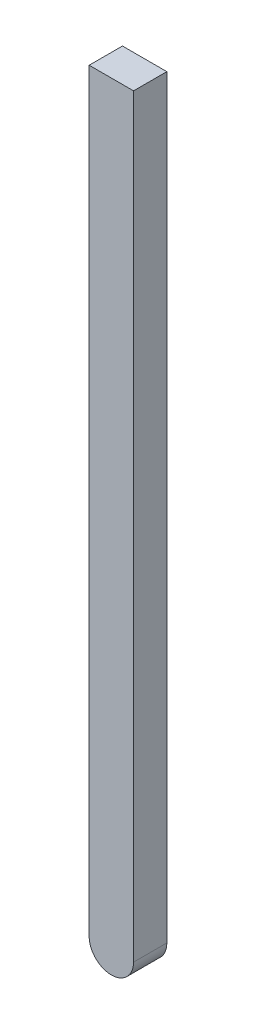
ISO-10303-21;
HEADER;
FILE_DESCRIPTION(('STEP AP214'),'2;1');
FILE_NAME('part.step','',(''),(''),'','','');
FILE_SCHEMA(('AUTOMOTIVE_DESIGN { 1 0 10303 214 1 1 1 1 }'));
ENDSEC;
DATA;
#1=APPLICATION_CONTEXT('core data for automotive mechanical design processes');
#2=APPLICATION_PROTOCOL_DEFINITION('international standard','automotive_design',2000,#1);
#3=PRODUCT_CONTEXT('',#1,'mechanical');
#4=PRODUCT('Part','Part','',(#3));
#5=PRODUCT_RELATED_PRODUCT_CATEGORY('part','',(#4));
#6=PRODUCT_DEFINITION_FORMATION('','',#4);
#7=PRODUCT_DEFINITION_CONTEXT('part definition',#1,'design');
#8=PRODUCT_DEFINITION('design','',#6,#7);
#9=PRODUCT_DEFINITION_SHAPE('','',#8);
#10=(LENGTH_UNIT() NAMED_UNIT(*) SI_UNIT(.MILLI.,.METRE.));
#11=(NAMED_UNIT(*) PLANE_ANGLE_UNIT() SI_UNIT($,.RADIAN.));
#12=(NAMED_UNIT(*) SI_UNIT($,.STERADIAN.) SOLID_ANGLE_UNIT());
#13=UNCERTAINTY_MEASURE_WITH_UNIT(LENGTH_MEASURE(1.E-05),#10,'distance_accuracy_value','');
#14=(GEOMETRIC_REPRESENTATION_CONTEXT(3) GLOBAL_UNCERTAINTY_ASSIGNED_CONTEXT((#13)) GLOBAL_UNIT_ASSIGNED_CONTEXT((#10,
#11,#12)) REPRESENTATION_CONTEXT('',''));
#15=CARTESIAN_POINT('',(0.,0.,0.));
#16=DIRECTION('',(0.,0.,1.));
#17=DIRECTION('',(1.,0.,0.));
#18=AXIS2_PLACEMENT_3D('',#15,#16,#17);
#19=CARTESIAN_POINT('',(0.,0.,30.));
#20=DIRECTION('',(1.,0.,0.));
#21=DIRECTION('',(0.,1.,0.));
#22=AXIS2_PLACEMENT_3D('',#19,#20,#21);
#23=PLANE('',#22);
#24=DIRECTION('',(0.,-1.,0.));
#25=VECTOR('',#24,1.);
#26=CARTESIAN_POINT('',(0.,0.,0.));
#27=LINE('',#26,#25);
#28=CARTESIAN_POINT('',(0.,0.,0.));
#29=VERTEX_POINT('',#28);
#30=CARTESIAN_POINT('',(0.,-680.,0.));
#31=VERTEX_POINT('',#30);
#32=EDGE_CURVE('E107',#29,#31,#27,.T.);
#33=ORIENTED_EDGE('',*,*,#32,.T.);
#34=DIRECTION('',(0.,0.,-1.));
#35=VECTOR('',#34,1.);
#36=CARTESIAN_POINT('',(0.,-680.,30.));
#37=LINE('',#36,#35);
#38=CARTESIAN_POINT('',(0.,-680.,30.));
#39=VERTEX_POINT('',#38);
#40=EDGE_CURVE('E11',#39,#31,#37,.T.);
#41=ORIENTED_EDGE('',*,*,#40,.F.);
#42=DIRECTION('',(0.,-1.,0.));
#43=VECTOR('',#42,1.);
#44=CARTESIAN_POINT('',(0.,0.,30.));
#45=LINE('',#44,#43);
#46=CARTESIAN_POINT('',(0.,0.,30.));
#47=VERTEX_POINT('',#46);
#48=EDGE_CURVE('E91',#47,#39,#45,.T.);
#49=ORIENTED_EDGE('',*,*,#48,.F.);
#50=DIRECTION('',(0.,0.,-1.));
#51=VECTOR('',#50,1.);
#52=CARTESIAN_POINT('',(0.,0.,30.));
#53=LINE('',#52,#51);
#54=EDGE_CURVE('E103',#47,#29,#53,.T.);
#55=ORIENTED_EDGE('',*,*,#54,.T.);
#56=EDGE_LOOP('',(#33,#41,#49,#55));
#57=FACE_BOUND('',#56,.T.);
#58=ADVANCED_FACE('F39',(#57),#23,.F.);
#59=CARTESIAN_POINT('',(20.0000000000001,-680.,30.));
#60=DIRECTION('',(0.,0.,-1.));
#61=DIRECTION('',(-1.,0.,0.));
#62=AXIS2_PLACEMENT_3D('',#59,#60,#61);
#63=CYLINDRICAL_SURFACE('',#62,20.);
#64=CARTESIAN_POINT('',(20.0000000000001,-680.,0.));
#65=DIRECTION('',(0.,0.,1.));
#66=DIRECTION('',(1.,0.,0.));
#67=AXIS2_PLACEMENT_3D('',#64,#65,#66);
#68=CIRCLE('',#67,20.);
#69=CARTESIAN_POINT('',(40.0000000000001,-680.,0.));
#70=VERTEX_POINT('',#69);
#71=EDGE_CURVE('E96',#31,#70,#68,.T.);
#72=ORIENTED_EDGE('',*,*,#71,.T.);
#73=DIRECTION('',(0.,0.,-1.));
#74=VECTOR('',#73,1.);
#75=CARTESIAN_POINT('',(40.0000000000001,-680.,30.));
#76=LINE('',#75,#74);
#77=CARTESIAN_POINT('',(40.0000000000001,-680.,30.));
#78=VERTEX_POINT('',#77);
#79=EDGE_CURVE('E48',#78,#70,#76,.T.);
#80=ORIENTED_EDGE('',*,*,#79,.F.);
#81=CARTESIAN_POINT('',(20.0000000000001,-680.,30.));
#82=DIRECTION('',(0.,0.,1.));
#83=DIRECTION('',(1.,0.,0.));
#84=AXIS2_PLACEMENT_3D('',#81,#82,#83);
#85=CIRCLE('',#84,20.);
#86=EDGE_CURVE('E86',#39,#78,#85,.T.);
#87=ORIENTED_EDGE('',*,*,#86,.F.);
#88=ORIENTED_EDGE('',*,*,#40,.T.);
#89=EDGE_LOOP('',(#72,#80,#87,#88));
#90=FACE_BOUND('',#89,.T.);
#91=ADVANCED_FACE('F95',(#90),#63,.T.);
#92=CARTESIAN_POINT('',(40.,0.,30.));
#93=DIRECTION('',(-1.,0.,0.));
#94=DIRECTION('',(0.,-1.,0.));
#95=AXIS2_PLACEMENT_3D('',#92,#93,#94);
#96=PLANE('',#95);
#97=DIRECTION('',(0.,1.,0.));
#98=VECTOR('',#97,1.);
#99=CARTESIAN_POINT('',(40.,0.,0.));
#100=LINE('',#99,#98);
#101=CARTESIAN_POINT('',(40.,0.,0.));
#102=VERTEX_POINT('',#101);
#103=EDGE_CURVE('E73',#70,#102,#100,.T.);
#104=ORIENTED_EDGE('',*,*,#103,.T.);
#105=DIRECTION('',(0.,0.,-1.));
#106=VECTOR('',#105,1.);
#107=CARTESIAN_POINT('',(40.,0.,30.));
#108=LINE('',#107,#106);
#109=CARTESIAN_POINT('',(40.,0.,30.));
#110=VERTEX_POINT('',#109);
#111=EDGE_CURVE('E98',#110,#102,#108,.T.);
#112=ORIENTED_EDGE('',*,*,#111,.F.);
#113=DIRECTION('',(0.,1.,0.));
#114=VECTOR('',#113,1.);
#115=CARTESIAN_POINT('',(40.,0.,30.));
#116=LINE('',#115,#114);
#117=EDGE_CURVE('E89',#78,#110,#116,.T.);
#118=ORIENTED_EDGE('',*,*,#117,.F.);
#119=ORIENTED_EDGE('',*,*,#79,.T.);
#120=EDGE_LOOP('',(#104,#112,#118,#119));
#121=FACE_BOUND('',#120,.T.);
#122=ADVANCED_FACE('F99',(#121),#96,.F.);
#123=CARTESIAN_POINT('',(0.,0.,30.));
#124=DIRECTION('',(0.,-1.,0.));
#125=DIRECTION('',(0.,0.,-1.));
#126=AXIS2_PLACEMENT_3D('',#123,#124,#125);
#127=PLANE('',#126);
#128=DIRECTION('',(-1.,0.,0.));
#129=VECTOR('',#128,1.);
#130=CARTESIAN_POINT('',(0.,0.,0.));
#131=LINE('',#130,#129);
#132=EDGE_CURVE('E79',#102,#29,#131,.T.);
#133=ORIENTED_EDGE('',*,*,#132,.T.);
#134=ORIENTED_EDGE('',*,*,#54,.F.);
#135=DIRECTION('',(-1.,0.,0.));
#136=VECTOR('',#135,1.);
#137=CARTESIAN_POINT('',(0.,0.,30.));
#138=LINE('',#137,#136);
#139=EDGE_CURVE('E56',#110,#47,#138,.T.);
#140=ORIENTED_EDGE('',*,*,#139,.F.);
#141=ORIENTED_EDGE('',*,*,#111,.T.);
#142=EDGE_LOOP('',(#133,#134,#140,#141));
#143=FACE_BOUND('',#142,.T.);
#144=ADVANCED_FACE('F120',(#143),#127,.F.);
#145=CARTESIAN_POINT('',(20.0000000000001,-680.,30.));
#146=DIRECTION('',(0.,0.,1.));
#147=DIRECTION('',(1.,0.,0.));
#148=AXIS2_PLACEMENT_3D('',#145,#146,#147);
#149=PLANE('',#148);
#150=ORIENTED_EDGE('',*,*,#48,.T.);
#151=ORIENTED_EDGE('',*,*,#86,.T.);
#152=ORIENTED_EDGE('',*,*,#117,.T.);
#153=ORIENTED_EDGE('',*,*,#139,.T.);
#154=EDGE_LOOP('',(#150,#151,#152,#153));
#155=FACE_BOUND('',#154,.T.);
#156=ADVANCED_FACE('F87',(#155),#149,.T.);
#157=CARTESIAN_POINT('',(20.0000000000001,-680.,0.));
#158=DIRECTION('',(0.,0.,1.));
#159=DIRECTION('',(1.,0.,0.));
#160=AXIS2_PLACEMENT_3D('',#157,#158,#159);
#161=PLANE('',#160);
#162=ORIENTED_EDGE('',*,*,#32,.F.);
#163=ORIENTED_EDGE('',*,*,#132,.F.);
#164=ORIENTED_EDGE('',*,*,#103,.F.);
#165=ORIENTED_EDGE('',*,*,#71,.F.);
#166=EDGE_LOOP('',(#162,#163,#164,#165));
#167=FACE_BOUND('',#166,.T.);
#168=ADVANCED_FACE('F123',(#167),#161,.F.);
#169=CLOSED_SHELL('',(#58,#91,#122,#144,#156,#168));
#170=MANIFOLD_SOLID_BREP('B2',#169);
#171=ADVANCED_BREP_SHAPE_REPRESENTATION('',(#18,#170),#14);
#172=SHAPE_DEFINITION_REPRESENTATION(#9,#171);
ENDSEC;
END-ISO-10303-21;
